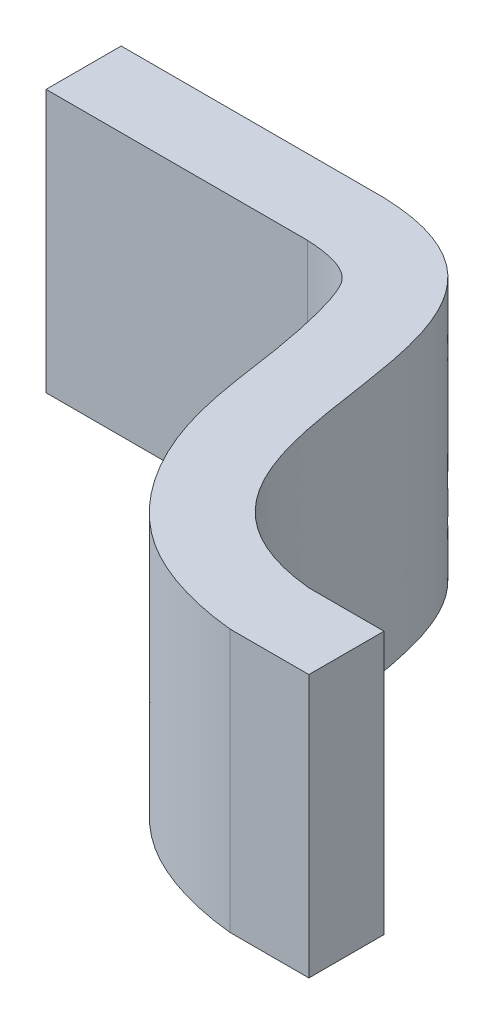
ISO-10303-21;
HEADER;
FILE_DESCRIPTION(('STEP AP214'),'2;1');
FILE_NAME('part.step','',(''),(''),'','','');
FILE_SCHEMA(('AUTOMOTIVE_DESIGN { 1 0 10303 214 1 1 1 1 }'));
ENDSEC;
DATA;
#1=APPLICATION_CONTEXT('core data for automotive mechanical design processes');
#2=APPLICATION_PROTOCOL_DEFINITION('international standard','automotive_design',2000,#1);
#3=PRODUCT_CONTEXT('',#1,'mechanical');
#4=PRODUCT('Part','Part','',(#3));
#5=PRODUCT_RELATED_PRODUCT_CATEGORY('part','',(#4));
#6=PRODUCT_DEFINITION_FORMATION('','',#4);
#7=PRODUCT_DEFINITION_CONTEXT('part definition',#1,'design');
#8=PRODUCT_DEFINITION('design','',#6,#7);
#9=PRODUCT_DEFINITION_SHAPE('','',#8);
#10=(LENGTH_UNIT() NAMED_UNIT(*) SI_UNIT(.MILLI.,.METRE.));
#11=(NAMED_UNIT(*) PLANE_ANGLE_UNIT() SI_UNIT($,.RADIAN.));
#12=(NAMED_UNIT(*) SI_UNIT($,.STERADIAN.) SOLID_ANGLE_UNIT());
#13=UNCERTAINTY_MEASURE_WITH_UNIT(LENGTH_MEASURE(1.E-05),#10,'distance_accuracy_value','');
#14=(GEOMETRIC_REPRESENTATION_CONTEXT(3) GLOBAL_UNCERTAINTY_ASSIGNED_CONTEXT((#13)) GLOBAL_UNIT_ASSIGNED_CONTEXT((#10,
#11,#12)) REPRESENTATION_CONTEXT('',''));
#15=CARTESIAN_POINT('',(0.,0.,0.));
#16=DIRECTION('',(0.,0.,1.));
#17=DIRECTION('',(1.,0.,0.));
#18=AXIS2_PLACEMENT_3D('',#15,#16,#17);
#19=CARTESIAN_POINT('',(0.381074398756027,2.52309917032561,1.20000011583518));
#20=DIRECTION('',(0.,-1.,-4.37113882867379E-08));
#21=DIRECTION('',(1.,0.,0.));
#22=AXIS2_PLACEMENT_3D('',#19,#20,#21);
#23=PLANE('',#22);
#24=CARTESIAN_POINT('',(-6.65392560124397,2.52309917906789,1.00000011583518));
#25=CARTESIAN_POINT('',(-6.6760213847098,2.52309917916311,0.997821625647133));
#26=CARTESIAN_POINT('',(-6.69813368756547,2.5230991793072,0.994525254588134));
#27=CARTESIAN_POINT('',(-6.74194760453987,2.52309917972469,0.984974262074383));
#28=CARTESIAN_POINT('',(-6.76364199343851,2.5230991799995,0.978687395714405));
#29=CARTESIAN_POINT('',(-6.8010868913745,2.52309918063201,0.964217324172014));
#30=CARTESIAN_POINT('',(-6.81710358266756,2.52309918095865,0.956744419949615));
#31=CARTESIAN_POINT('',(-6.84769864594612,2.52309918171697,0.939396173252146));
#32=CARTESIAN_POINT('',(-6.86228342605002,2.52309918214814,0.929532290820285));
#33=CARTESIAN_POINT('',(-6.88912475678651,2.52309918309555,0.907858082970573));
#34=CARTESIAN_POINT('',(-6.90144309560176,2.52309918360844,0.896124342958262));
#35=CARTESIAN_POINT('',(-6.92409093426443,2.52309918471315,0.870851464463273));
#36=CARTESIAN_POINT('',(-6.93441702178863,2.5230991853051,0.857309294454853));
#37=CARTESIAN_POINT('',(-6.96671116783855,2.52309918745188,0.808196656260226));
#38=CARTESIAN_POINT('',(-6.98363339651492,2.52309918914941,0.769361671126784));
#39=CARTESIAN_POINT('',(-7.00636675343762,2.52309919217834,0.70006788295555));
#40=CARTESIAN_POINT('',(-7.01392037587509,2.52309919349072,0.670044134037491));
#41=CARTESIAN_POINT('',(-7.02679822502435,2.523099196139,0.609458553545979));
#42=CARTESIAN_POINT('',(-7.03211866901882,2.52309919747493,0.578895899629316));
#43=CARTESIAN_POINT('',(-7.04522373011164,2.52309920105377,0.497021613893752));
#44=CARTESIAN_POINT('',(-7.05225323067938,2.52309920330128,0.445604791047077));
#45=CARTESIAN_POINT('',(-7.06582589653957,2.52309920665086,0.368975308105409));
#46=CARTESIAN_POINT('',(-7.07085237182358,2.52309920776336,0.343524341633868));
#47=CARTESIAN_POINT('',(-7.08288891244714,2.52309920996658,0.293120463878792));
#48=CARTESIAN_POINT('',(-7.0898957194452,2.52309921105734,0.268166805951377));
#49=CARTESIAN_POINT('',(-7.10753002382366,2.52309921323841,0.218269756020573));
#50=CARTESIAN_POINT('',(-7.11829723428463,2.52309921432677,0.193370816281339));
#51=CARTESIAN_POINT('',(-7.13813270077437,2.52309921586495,0.158181376299541));
#52=CARTESIAN_POINT('',(-7.14532993400949,2.52309921636052,0.146844082596574));
#53=CARTESIAN_POINT('',(-7.16104748346313,2.52309921730947,0.125134668490086));
#54=CARTESIAN_POINT('',(-7.1695665343253,2.52309921776288,0.114761640040044));
#55=CARTESIAN_POINT('',(-7.19090199977994,2.52309921875355,0.0920977228508137));
#56=CARTESIAN_POINT('',(-7.20421803422598,2.52309921927065,0.0802681611591474));
#57=CARTESIAN_POINT('',(-7.23279289498045,2.52309922019085,0.0592163446175961));
#58=CARTESIAN_POINT('',(-7.24805496936829,2.52309922059377,0.0499985337989562));
#59=CARTESIAN_POINT('',(-7.28054440722777,2.52309922129869,0.0338719510890802));
#60=CARTESIAN_POINT('',(-7.29782779482495,2.52309922159565,0.0270782714989052));
#61=CARTESIAN_POINT('',(-7.33319650573112,2.52309922208002,0.0159971892214253));
#62=CARTESIAN_POINT('',(-7.35128360657443,2.52309922226717,0.0117156730828422));
#63=CARTESIAN_POINT('',(-7.38352182929289,2.5230992225183,0.0059706276691555));
#64=CARTESIAN_POINT('',(-7.39760256337062,2.52309922260085,0.00408194344411804));
#65=CARTESIAN_POINT('',(-7.4257638425411,2.5230992227211,0.00133095304899247));
#66=CARTESIAN_POINT('',(-7.43984365839325,2.52309922275911,0.000461351631184867));
#67=CARTESIAN_POINT('',(-7.45392560124401,2.52309922277927,1.1583517777948E-07));
#68=B_SPLINE_CURVE_WITH_KNOTS('',3,(#24,#25,#26,#27,#28,#29,#30,#31,#32,#33,#34,#35,#36,#37,#38,
#39,#40,#41,#42,#43,#44,#45,#46,#47,#48,#49,#50,#51,#52,#53,#54,#55,#56,#57,#58,#59,#60,#61,#62,
#63,#64,#65,#66,#67),.UNSPECIFIED.,.F.,.F.,(4,2,2,2,2,2,2,2,2,2,2,2,2,2,2,2,2,2,2,2,2,4),(0.,
0.0667821137090891,0.134301214684032,0.187128508823995,0.239707439757743,0.290518731452934,
0.341416294675061,0.466712259088972,0.559563019654511,0.652570428897923,0.808245450373597,
0.886023921415196,0.963675157190788,1.04458784966541,1.08478909463837,1.12495209032638,
1.17807587168457,1.2312895104201,1.28677003517691,1.34238004906255,1.38496468867345,
1.42724258099923),.UNSPECIFIED.);
#69=CARTESIAN_POINT('',(-6.65392560124397,2.52309917906789,1.00000011583518));
#70=VERTEX_POINT('',#69);
#71=CARTESIAN_POINT('',(-7.45392560124397,2.52309922277927,1.15835178959856E-07));
#72=VERTEX_POINT('',#71);
#73=EDGE_CURVE('E11',#70,#72,#68,.T.);
#74=ORIENTED_EDGE('',*,*,#73,.F.);
#75=DIRECTION('',(-1.,0.,0.));
#76=VECTOR('',#75,1.);
#77=CARTESIAN_POINT('',(-6.45392560124397,2.52309917906788,1.00000011583518));
#78=LINE('',#77,#76);
#79=CARTESIAN_POINT('',(-6.45392560124397,2.52309917906789,1.00000011583518));
#80=VERTEX_POINT('',#79);
#81=EDGE_CURVE('E177',#80,#70,#78,.T.);
#82=ORIENTED_EDGE('',*,*,#81,.F.);
#83=DIRECTION('',(0.,4.37113878426487E-08,-0.999999999999999));
#84=VECTOR('',#83,1.);
#85=CARTESIAN_POINT('',(-6.45392560124397,2.52309917032561,1.20000011583518));
#86=LINE('',#85,#84);
#87=CARTESIAN_POINT('',(-6.45392560124397,2.52309917032561,1.20000011583518));
#88=VERTEX_POINT('',#87);
#89=EDGE_CURVE('E156',#88,#80,#86,.T.);
#90=ORIENTED_EDGE('',*,*,#89,.F.);
#91=DIRECTION('',(-1.,0.,0.));
#92=VECTOR('',#91,1.);
#93=CARTESIAN_POINT('',(-6.45392560124397,2.52309917032561,1.20000011583518));
#94=LINE('',#93,#92);
#95=CARTESIAN_POINT('',(-6.66372477809197,2.52309917032561,1.20000011583518));
#96=VERTEX_POINT('',#95);
#97=EDGE_CURVE('E147',#88,#96,#94,.T.);
#98=ORIENTED_EDGE('',*,*,#97,.T.);
#99=CARTESIAN_POINT('',(-6.66372477809197,2.52309917032561,1.20000011583518));
#100=CARTESIAN_POINT('',(-6.68235816480651,2.52309917040612,1.19815826251359));
#101=CARTESIAN_POINT('',(-6.70093498946342,2.52309917051351,1.19570148608563));
#102=CARTESIAN_POINT('',(-6.73791221278168,2.52309917078471,1.18949708649844));
#103=CARTESIAN_POINT('',(-6.75631214417819,2.52309917094865,1.18574668900368));
#104=CARTESIAN_POINT('',(-6.79295513620438,2.52309917133702,1.17686171267063));
#105=CARTESIAN_POINT('',(-6.8111952940445,2.52309917156199,1.1717149784766));
#106=CARTESIAN_POINT('',(-6.84717172345389,2.52309917207712,1.15993018576616));
#107=CARTESIAN_POINT('',(-6.86490837899947,2.52309917236723,1.15329330005595));
#108=CARTESIAN_POINT('',(-6.90549462665057,2.52309917313077,1.13582558687806));
#109=CARTESIAN_POINT('',(-6.92807290255751,2.52309917363307,1.12433438176826));
#110=CARTESIAN_POINT('',(-6.97096829666688,2.5230991747892,1.09788516164198));
#111=CARTESIAN_POINT('',(-6.9912955036889,2.52309917544231,1.08294362493377));
#112=CARTESIAN_POINT('',(-7.02796037846709,2.5230991768155,1.0515286278821));
#113=CARTESIAN_POINT('',(-7.04448684621663,2.52309917752611,1.03527193186483));
#114=CARTESIAN_POINT('',(-7.07542126022009,2.52309917903329,1.00079161319614));
#115=CARTESIAN_POINT('',(-7.08982362168071,2.52309917983008,0.982563016394579));
#116=CARTESIAN_POINT('',(-7.11808537102814,2.52309918158959,0.942310234871584));
#117=CARTESIAN_POINT('',(-7.1316696505039,2.52309918256072,0.92009344839241));
#118=CARTESIAN_POINT('',(-7.15605550233222,2.52309918456551,0.874229233248659));
#119=CARTESIAN_POINT('',(-7.16686079670802,2.52309918559908,0.850583771081586));
#120=CARTESIAN_POINT('',(-7.18656671922941,2.52309918779927,0.800249242615178));
#121=CARTESIAN_POINT('',(-7.19523524065515,2.52309918896982,0.773470351336701));
#122=CARTESIAN_POINT('',(-7.20995546192352,2.52309919134218,0.719197095461251));
#123=CARTESIAN_POINT('',(-7.21600397870322,2.52309919254403,0.691701903357667));
#124=CARTESIAN_POINT('',(-7.22444466903982,2.52309919451031,0.646718698606681));
#125=CARTESIAN_POINT('',(-7.22735928328766,2.52309919527076,0.629321559392239));
#126=CARTESIAN_POINT('',(-7.23280873084802,2.52309919679438,0.594465151128248));
#127=CARTESIAN_POINT('',(-7.23534347790799,2.52309919755755,0.577005868887041));
#128=CARTESIAN_POINT('',(-7.24043139259136,2.52309919908365,0.542092921691093));
#129=CARTESIAN_POINT('',(-7.24298455656837,2.52309919984657,0.524639256302372));
#130=CARTESIAN_POINT('',(-7.24852784389109,2.52309920136919,0.489805710668549));
#131=CARTESIAN_POINT('',(-7.25151784908981,2.52309920212889,0.472425811776498));
#132=CARTESIAN_POINT('',(-7.2593930344497,2.52309920398264,0.430017002300889));
#133=CARTESIAN_POINT('',(-7.26452884999095,2.52309920507476,0.405032274084384));
#134=CARTESIAN_POINT('',(-7.27334542318719,2.52309920670167,0.367812997253911));
#135=CARTESIAN_POINT('',(-7.27647049737492,2.5230992072422,0.355447076609879));
#136=CARTESIAN_POINT('',(-7.28323298853228,2.52309920831701,0.330858185679059));
#137=CARTESIAN_POINT('',(-7.28687011761276,2.52309920885128,0.318635139218728));
#138=CARTESIAN_POINT('',(-7.29334407740757,2.52309920969326,0.299373483484268));
#139=CARTESIAN_POINT('',(-7.2959066269859,2.52309921000491,0.292244069713015));
#140=CARTESIAN_POINT('',(-7.30148473904446,2.52309921061997,0.278171981621579));
#141=CARTESIAN_POINT('',(-7.30449961539945,2.52309921092339,0.271229042931886));
#142=CARTESIAN_POINT('',(-7.31076754414832,2.5230992114581,0.259000030679789));
#143=CARTESIAN_POINT('',(-7.31387365469767,2.52309921169237,0.25364485399594));
#144=CARTESIAN_POINT('',(-7.32080381678023,2.52309921209967,0.24431611299945));
#145=CARTESIAN_POINT('',(-7.32450000384901,2.52309921227667,0.240254092219712));
#146=CARTESIAN_POINT('',(-7.33394897363332,2.5230992126361,0.232076082050639));
#147=CARTESIAN_POINT('',(-7.33998642044214,2.52309921280446,0.228304167822837));
#148=CARTESIAN_POINT('',(-7.34920308092036,2.52309921302749,0.223113207552908));
#149=CARTESIAN_POINT('',(-7.35228960650534,2.5230992130967,0.22146627616053));
#150=CARTESIAN_POINT('',(-7.35857989092758,2.52309921323393,0.218417487597743));
#151=CARTESIAN_POINT('',(-7.36178332741555,2.52309921330194,0.217015010267045));
#152=CARTESIAN_POINT('',(-7.37090352258754,2.52309921346706,0.213465158251479));
#153=CARTESIAN_POINT('',(-7.37693693346537,2.52309921354377,0.211621815116613));
#154=CARTESIAN_POINT('',(-7.38670569686491,2.52309921364324,0.209137323184538));
#155=CARTESIAN_POINT('',(-7.39039887638499,2.52309921367532,0.20830980891405));
#156=CARTESIAN_POINT('',(-7.39781445722382,2.52309921373823,0.206799773992657));
#157=CARTESIAN_POINT('',(-7.40153685423347,2.52309921376905,0.206117232362365));
#158=CARTESIAN_POINT('',(-7.41389968086125,2.52309921386204,0.204032192061863));
#159=CARTESIAN_POINT('',(-7.42257948480063,2.52309921391219,0.20286122616549));
#160=CARTESIAN_POINT('',(-7.43563044947402,2.52309921397233,0.201476711110414));
#161=CARTESIAN_POINT('',(-7.43998307619468,2.52309921398985,0.201077337289078));
#162=CARTESIAN_POINT('',(-7.44869872182374,2.52309921401853,0.200424106581843));
#163=CARTESIAN_POINT('',(-7.45306173976726,2.52309921402969,0.200170236676359));
#164=CARTESIAN_POINT('',(-7.45742938297997,2.523099214037,0.200000115835179));
#165=B_SPLINE_CURVE_WITH_KNOTS('',3,(#99,#100,#101,#102,#103,#104,#105,#106,#107,#108,#109,#110,
#111,#112,#113,#114,#115,#116,#117,#118,#119,#120,#121,#122,#123,#124,#125,#126,#127,#128,#129,
#130,#131,#132,#133,#134,#135,#136,#137,#138,#139,#140,#141,#142,#143,#144,#145,#146,#147,#148,
#149,#150,#151,#152,#153,#154,#155,#156,#157,#158,#159,#160,#161,#162,#163,#164),.UNSPECIFIED.,
.F.,.F.,(4,2,2,2,2,2,2,2,2,2,2,2,2,2,2,2,2,2,2,2,2,2,2,2,2,2,2,2,2,2,2,2,4),(0.,
0.0561681589095707,0.112457534383138,0.16925357861237,0.226005077906886,0.301715004036544,
0.377070566346001,0.446424912055152,0.515958475234817,0.593880428548584,0.671697467408244,
0.75596451716301,0.84033365838221,0.89324779263184,0.946173923407372,0.999089848164163,
1.05199148781442,1.12847716172405,1.16673541076623,1.20497223539784,1.22769072756634,
1.25037510056687,1.26886797593494,1.28517999290264,1.30634908955327,1.3168513921173,
1.32732665061524,1.34619861049414,1.35755137220421,1.36890248990409,1.39515927363249,
1.40827024085607,1.42138003473644),.UNSPECIFIED.);
#166=CARTESIAN_POINT('',(-7.45742938297997,2.523099214037,0.200000115835179));
#167=VERTEX_POINT('',#166);
#168=EDGE_CURVE('E135',#96,#167,#165,.T.);
#169=ORIENTED_EDGE('',*,*,#168,.T.);
#170=DIRECTION('',(1.,0.,0.));
#171=VECTOR('',#170,1.);
#172=CARTESIAN_POINT('',(-8.15392560124397,2.523099214037,0.200000115835177));
#173=LINE('',#172,#171);
#174=CARTESIAN_POINT('',(-8.15392560124397,2.523099214037,0.200000115835179));
#175=VERTEX_POINT('',#174);
#176=EDGE_CURVE('E97',#175,#167,#173,.T.);
#177=ORIENTED_EDGE('',*,*,#176,.F.);
#178=DIRECTION('',(0.,4.37113878426487E-08,-0.999999999999999));
#179=VECTOR('',#178,1.);
#180=CARTESIAN_POINT('',(-8.15392560124397,2.523099214037,0.200000115835179));
#181=LINE('',#180,#179);
#182=CARTESIAN_POINT('',(-8.15392560124397,2.52309922277927,1.15835178959856E-07));
#183=VERTEX_POINT('',#182);
#184=EDGE_CURVE('E102',#175,#183,#181,.T.);
#185=ORIENTED_EDGE('',*,*,#184,.T.);
#186=DIRECTION('',(-1.,0.,0.));
#187=VECTOR('',#186,1.);
#188=CARTESIAN_POINT('',(-7.45392560124397,2.52309922277928,1.15835178959856E-07));
#189=LINE('',#188,#187);
#190=EDGE_CURVE('E95',#72,#183,#189,.T.);
#191=ORIENTED_EDGE('',*,*,#190,.F.);
#192=EDGE_LOOP('',(#74,#82,#90,#98,#169,#177,#185,#191));
#193=FACE_BOUND('',#192,.T.);
#194=ADVANCED_FACE('F17',(#193),#23,.T.);
#195=CARTESIAN_POINT('',(0.381074398756027,3.22309917032561,1.20000014643315));
#196=DIRECTION('',(0.,-1.,-4.37113882867379E-08));
#197=DIRECTION('',(1.,0.,0.));
#198=AXIS2_PLACEMENT_3D('',#195,#196,#197);
#199=PLANE('',#198);
#200=DIRECTION('',(-1.,0.,0.));
#201=VECTOR('',#200,1.);
#202=CARTESIAN_POINT('',(-6.45392560124397,3.22309917906788,1.00000014643315));
#203=LINE('',#202,#201);
#204=CARTESIAN_POINT('',(-6.45392560124397,3.22309917906789,1.00000014643315));
#205=VERTEX_POINT('',#204);
#206=CARTESIAN_POINT('',(-6.65392560124397,3.22309917906789,1.00000014643315));
#207=VERTEX_POINT('',#206);
#208=EDGE_CURVE('E30',#205,#207,#203,.T.);
#209=ORIENTED_EDGE('',*,*,#208,.T.);
#210=CARTESIAN_POINT('',(-6.65392560124397,3.22309917906789,1.00000014643315));
#211=CARTESIAN_POINT('',(-6.6760213847098,3.22309917916311,0.997821656245104));
#212=CARTESIAN_POINT('',(-6.69813368756547,3.2230991793072,0.994525285186106));
#213=CARTESIAN_POINT('',(-6.74194760453987,3.22309917972469,0.984974292672355));
#214=CARTESIAN_POINT('',(-6.76364199343851,3.2230991799995,0.978687426312377));
#215=CARTESIAN_POINT('',(-6.8010868913745,3.22309918063201,0.964217354769986));
#216=CARTESIAN_POINT('',(-6.81710358266756,3.22309918095865,0.956744450547586));
#217=CARTESIAN_POINT('',(-6.84769864594612,3.22309918171697,0.939396203850117));
#218=CARTESIAN_POINT('',(-6.86228342605002,3.22309918214814,0.929532321418256));
#219=CARTESIAN_POINT('',(-6.88912475678651,3.22309918309555,0.907858113568546));
#220=CARTESIAN_POINT('',(-6.90144309560176,3.22309918360844,0.896124373556235));
#221=CARTESIAN_POINT('',(-6.92409093426443,3.22309918471315,0.870851495061246));
#222=CARTESIAN_POINT('',(-6.93441702178864,3.2230991853051,0.857309325052826));
#223=CARTESIAN_POINT('',(-6.96671116783855,3.22309918745188,0.808196686858197));
#224=CARTESIAN_POINT('',(-6.98363339651492,3.22309918914941,0.769361701724756));
#225=CARTESIAN_POINT('',(-7.00636675343762,3.22309919217834,0.700067913553522));
#226=CARTESIAN_POINT('',(-7.01392037587509,3.22309919349072,0.670044164635463));
#227=CARTESIAN_POINT('',(-7.02679822502436,3.223099196139,0.609458584143951));
#228=CARTESIAN_POINT('',(-7.03211866901882,3.22309919747493,0.578895930227288));
#229=CARTESIAN_POINT('',(-7.04522373011164,3.22309920105377,0.497021644491724));
#230=CARTESIAN_POINT('',(-7.05225323067938,3.22309920330128,0.445604821645049));
#231=CARTESIAN_POINT('',(-7.06582589653957,3.22309920665086,0.368975338703381));
#232=CARTESIAN_POINT('',(-7.07085237182357,3.22309920776336,0.343524372231839));
#233=CARTESIAN_POINT('',(-7.08288891244714,3.22309920996658,0.293120494476764));
#234=CARTESIAN_POINT('',(-7.0898957194452,3.22309921105734,0.268166836549349));
#235=CARTESIAN_POINT('',(-7.10753002382366,3.22309921323841,0.218269786618545));
#236=CARTESIAN_POINT('',(-7.11829723428463,3.22309921432677,0.193370846879311));
#237=CARTESIAN_POINT('',(-7.13813270077437,3.22309921586495,0.158181406897513));
#238=CARTESIAN_POINT('',(-7.14532993400949,3.22309921636052,0.146844113194547));
#239=CARTESIAN_POINT('',(-7.16104748346313,3.22309921730947,0.125134699088058));
#240=CARTESIAN_POINT('',(-7.1695665343253,3.22309921776288,0.114761670638016));
#241=CARTESIAN_POINT('',(-7.19090199977994,3.22309921875355,0.0920977534487856));
#242=CARTESIAN_POINT('',(-7.20421803422598,3.22309921927065,0.0802681917571193));
#243=CARTESIAN_POINT('',(-7.23279289498045,3.22309922019085,0.059216375215568));
#244=CARTESIAN_POINT('',(-7.24805496936829,3.22309922059377,0.049998564396928));
#245=CARTESIAN_POINT('',(-7.28054440722777,3.22309922129869,0.0338719816870522));
#246=CARTESIAN_POINT('',(-7.29782779482495,3.22309922159565,0.0270783020968775));
#247=CARTESIAN_POINT('',(-7.33319650573112,3.22309922208002,0.0159972198193975));
#248=CARTESIAN_POINT('',(-7.35128360657443,3.22309922226717,0.0117157036808142));
#249=CARTESIAN_POINT('',(-7.38352182929289,3.2230992225183,0.00597065826712729));
#250=CARTESIAN_POINT('',(-7.39760256337062,3.22309922260085,0.00408197404208983));
#251=CARTESIAN_POINT('',(-7.4257638425411,3.2230992227211,0.00133098364696428));
#252=CARTESIAN_POINT('',(-7.43984365839325,3.22309922275911,0.000461382229156693));
#253=CARTESIAN_POINT('',(-7.45392560124401,3.22309922277927,1.46433149535788E-07));
#254=B_SPLINE_CURVE_WITH_KNOTS('',3,(#210,#211,#212,#213,#214,#215,#216,#217,#218,#219,#220,
#221,#222,#223,#224,#225,#226,#227,#228,#229,#230,#231,#232,#233,#234,#235,#236,#237,#238,#239,
#240,#241,#242,#243,#244,#245,#246,#247,#248,#249,#250,#251,#252,#253),.UNSPECIFIED.,.F.,.F.,(4,
2,2,2,2,2,2,2,2,2,2,2,2,2,2,2,2,2,2,2,2,4),(0.,0.0667821137090888,0.134301214684031,
0.187128508823994,0.239707439757743,0.290518731452934,0.34141629467506,0.466712259088972,
0.559563019654511,0.652570428897923,0.808245450373597,0.886023921415196,0.963675157190788,
1.04458784966541,1.08478909463837,1.12495209032638,1.17807587168457,1.2312895104201,
1.28677003517691,1.34238004906255,1.38496468867345,1.42724258099923),.UNSPECIFIED.);
#255=CARTESIAN_POINT('',(-7.45392560124397,3.22309922277927,1.46433150760572E-07));
#256=VERTEX_POINT('',#255);
#257=EDGE_CURVE('E159',#207,#256,#254,.T.);
#258=ORIENTED_EDGE('',*,*,#257,.T.);
#259=DIRECTION('',(-1.,0.,0.));
#260=VECTOR('',#259,1.);
#261=CARTESIAN_POINT('',(-7.45392560124397,3.22309922277928,1.46433150760572E-07));
#262=LINE('',#261,#260);
#263=CARTESIAN_POINT('',(-8.15392560124397,3.22309922277927,1.46433150760572E-07));
#264=VERTEX_POINT('',#263);
#265=EDGE_CURVE('E96',#256,#264,#262,.T.);
#266=ORIENTED_EDGE('',*,*,#265,.T.);
#267=DIRECTION('',(0.,4.37113856222026E-08,-0.999999999999999));
#268=VECTOR('',#267,1.);
#269=CARTESIAN_POINT('',(-8.15392560124397,3.223099214037,0.200000146433151));
#270=LINE('',#269,#268);
#271=CARTESIAN_POINT('',(-8.15392560124397,3.223099214037,0.200000146433151));
#272=VERTEX_POINT('',#271);
#273=EDGE_CURVE('E141',#272,#264,#270,.T.);
#274=ORIENTED_EDGE('',*,*,#273,.F.);
#275=DIRECTION('',(1.,0.,0.));
#276=VECTOR('',#275,1.);
#277=CARTESIAN_POINT('',(-8.15392560124397,3.223099214037,0.200000146433149));
#278=LINE('',#277,#276);
#279=CARTESIAN_POINT('',(-7.45742938297997,3.223099214037,0.200000146433151));
#280=VERTEX_POINT('',#279);
#281=EDGE_CURVE('E193',#272,#280,#278,.T.);
#282=ORIENTED_EDGE('',*,*,#281,.T.);
#283=CARTESIAN_POINT('',(-6.66372477809197,3.22309917032561,1.20000014643315));
#284=CARTESIAN_POINT('',(-6.68235816480651,3.22309917040612,1.19815829311156));
#285=CARTESIAN_POINT('',(-6.70093498946342,3.22309917051351,1.1957015166836));
#286=CARTESIAN_POINT('',(-6.73791221278168,3.22309917078471,1.18949711709641));
#287=CARTESIAN_POINT('',(-6.75631214417819,3.22309917094865,1.18574671960165));
#288=CARTESIAN_POINT('',(-6.79295513620438,3.22309917133702,1.1768617432686));
#289=CARTESIAN_POINT('',(-6.8111952940445,3.22309917156199,1.17171500907457));
#290=CARTESIAN_POINT('',(-6.84717172345389,3.22309917207712,1.15993021636413));
#291=CARTESIAN_POINT('',(-6.86490837899947,3.22309917236723,1.15329333065392));
#292=CARTESIAN_POINT('',(-6.90549462665057,3.22309917313077,1.13582561747603));
#293=CARTESIAN_POINT('',(-6.92807290255751,3.22309917363307,1.12433441236623));
#294=CARTESIAN_POINT('',(-6.97096829666688,3.2230991747892,1.09788519223995));
#295=CARTESIAN_POINT('',(-6.9912955036889,3.22309917544231,1.08294365553175));
#296=CARTESIAN_POINT('',(-7.02796037846709,3.2230991768155,1.05152865848007));
#297=CARTESIAN_POINT('',(-7.04448684621663,3.22309917752611,1.03527196246281));
#298=CARTESIAN_POINT('',(-7.07542126022009,3.22309917903329,1.00079164379411));
#299=CARTESIAN_POINT('',(-7.08982362168071,3.22309917983008,0.98256304699255));
#300=CARTESIAN_POINT('',(-7.11808537102814,3.22309918158959,0.942310265469555));
#301=CARTESIAN_POINT('',(-7.1316696505039,3.22309918256072,0.920093478990381));
#302=CARTESIAN_POINT('',(-7.15605550233222,3.22309918456551,0.87422926384663));
#303=CARTESIAN_POINT('',(-7.16686079670802,3.22309918559908,0.850583801679557));
#304=CARTESIAN_POINT('',(-7.18656671922941,3.22309918779927,0.80024927321315));
#305=CARTESIAN_POINT('',(-7.19523524065514,3.22309918896982,0.773470381934672));
#306=CARTESIAN_POINT('',(-7.20995546192352,3.22309919134218,0.719197126059223));
#307=CARTESIAN_POINT('',(-7.21600397870321,3.22309919254403,0.691701933955639));
#308=CARTESIAN_POINT('',(-7.22444466903983,3.22309919451031,0.646718729204653));
#309=CARTESIAN_POINT('',(-7.22735928328766,3.22309919527076,0.629321589990211));
#310=CARTESIAN_POINT('',(-7.23280873084802,3.22309919679438,0.59446518172622));
#311=CARTESIAN_POINT('',(-7.235343477908,3.22309919755755,0.577005899485013));
#312=CARTESIAN_POINT('',(-7.24043139259136,3.22309919908365,0.542092952289065));
#313=CARTESIAN_POINT('',(-7.24298455656837,3.22309919984657,0.524639286900344));
#314=CARTESIAN_POINT('',(-7.24852784389109,3.22309920136919,0.489805741266521));
#315=CARTESIAN_POINT('',(-7.25151784908981,3.22309920212889,0.47242584237447));
#316=CARTESIAN_POINT('',(-7.2593930344497,3.22309920398264,0.430017032898861));
#317=CARTESIAN_POINT('',(-7.26452884999095,3.22309920507476,0.405032304682356));
#318=CARTESIAN_POINT('',(-7.27334542318719,3.22309920670166,0.367813027851883));
#319=CARTESIAN_POINT('',(-7.27647049737492,3.22309920724219,0.355447107207851));
#320=CARTESIAN_POINT('',(-7.28323298853228,3.22309920831701,0.330858216277031));
#321=CARTESIAN_POINT('',(-7.28687011761276,3.22309920885131,0.3186351698167));
#322=CARTESIAN_POINT('',(-7.29334407740757,3.22309920969325,0.29937351408224));
#323=CARTESIAN_POINT('',(-7.2959066269859,3.22309921000488,0.292244100310987));
#324=CARTESIAN_POINT('',(-7.30148473904446,3.22309921062001,0.278172012219551));
#325=CARTESIAN_POINT('',(-7.30449961539945,3.22309921092352,0.271229073529858));
#326=CARTESIAN_POINT('',(-7.31076754414832,3.22309921145799,0.259000061277761));
#327=CARTESIAN_POINT('',(-7.31387365469767,3.22309921169199,0.253644884593912));
#328=CARTESIAN_POINT('',(-7.32080381678023,3.22309921209999,0.244316143597422));
#329=CARTESIAN_POINT('',(-7.32450000384901,3.22309921227781,0.240254122817684));
#330=CARTESIAN_POINT('',(-7.33394897363332,3.22309921263433,0.232076112648611));
#331=CARTESIAN_POINT('',(-7.33998642044214,3.22309921279752,0.228304198420809));
#332=CARTESIAN_POINT('',(-7.34920308092036,3.22309921302631,0.22311323815088));
#333=CARTESIAN_POINT('',(-7.35228960650534,3.22309921309965,0.221466306758503));
#334=CARTESIAN_POINT('',(-7.35857989092758,3.22309921323099,0.218417518195714));
#335=CARTESIAN_POINT('',(-7.36178332741555,3.22309921328903,0.217015040865017));
#336=CARTESIAN_POINT('',(-7.37090352258754,3.22309921343936,0.21346518884945));
#337=CARTESIAN_POINT('',(-7.37693693346537,3.22309921352181,0.211621845714585));
#338=CARTESIAN_POINT('',(-7.38670569686491,3.22309921363485,0.20913735378251));
#339=CARTESIAN_POINT('',(-7.39039887638499,3.22309921367301,0.208309839512022));
#340=CARTESIAN_POINT('',(-7.39781445722382,3.22309921374053,0.206799804590628));
#341=CARTESIAN_POINT('',(-7.40153685423347,3.22309921376988,0.206117262960336));
#342=CARTESIAN_POINT('',(-7.41389968086125,3.22309921386012,0.204032222659834));
#343=CARTESIAN_POINT('',(-7.42257948480063,3.22309921391181,0.202861256763462));
#344=CARTESIAN_POINT('',(-7.43563044947402,3.22309921397252,0.201476741708386));
#345=CARTESIAN_POINT('',(-7.43998307619468,3.22309921398994,0.201077367887049));
#346=CARTESIAN_POINT('',(-7.44869872182374,3.22309921401843,0.200424137179815));
#347=CARTESIAN_POINT('',(-7.45306173976726,3.2230992140295,0.200170267274331));
#348=CARTESIAN_POINT('',(-7.45742938297997,3.223099214037,0.200000146433151));
#349=B_SPLINE_CURVE_WITH_KNOTS('',3,(#283,#284,#285,#286,#287,#288,#289,#290,#291,#292,#293,
#294,#295,#296,#297,#298,#299,#300,#301,#302,#303,#304,#305,#306,#307,#308,#309,#310,#311,#312,
#313,#314,#315,#316,#317,#318,#319,#320,#321,#322,#323,#324,#325,#326,#327,#328,#329,#330,#331,
#332,#333,#334,#335,#336,#337,#338,#339,#340,#341,#342,#343,#344,#345,#346,#347,#348),
.UNSPECIFIED.,.F.,.F.,(4,2,2,2,2,2,2,2,2,2,2,2,2,2,2,2,2,2,2,2,2,2,2,2,2,2,2,2,2,2,2,2,4),(0.,
0.0561681589095705,0.112457534383138,0.16925357861237,0.226005077906886,0.301715004036544,
0.377070566346001,0.446424912055152,0.515958475234816,0.593880428548584,0.671697467408244,
0.755964517163009,0.840333658382208,0.893247792631839,0.946173923407371,0.999089848164162,
1.05199148781442,1.12847716172405,1.16673541076623,1.20497223539784,1.22769072756634,
1.25037510056687,1.26886797593494,1.28517999290264,1.30634908955327,1.31685139211729,
1.32732665061524,1.34619861049414,1.35755137220421,1.36890248990409,1.39515927363249,
1.40827024085607,1.42138003473644),.UNSPECIFIED.);
#350=CARTESIAN_POINT('',(-6.66372477809197,3.22309917032561,1.20000014643315));
#351=VERTEX_POINT('',#350);
#352=EDGE_CURVE('E103',#351,#280,#349,.T.);
#353=ORIENTED_EDGE('',*,*,#352,.F.);
#354=DIRECTION('',(-1.,0.,0.));
#355=VECTOR('',#354,1.);
#356=CARTESIAN_POINT('',(-6.45392560124397,3.22309917032561,1.20000014643315));
#357=LINE('',#356,#355);
#358=CARTESIAN_POINT('',(-6.45392560124397,3.22309917032561,1.20000014643315));
#359=VERTEX_POINT('',#358);
#360=EDGE_CURVE('E165',#359,#351,#357,.T.);
#361=ORIENTED_EDGE('',*,*,#360,.F.);
#362=DIRECTION('',(0.,4.37113878426487E-08,-0.999999999999999));
#363=VECTOR('',#362,1.);
#364=CARTESIAN_POINT('',(-6.45392560124397,3.22309917032561,1.20000014643315));
#365=LINE('',#364,#363);
#366=EDGE_CURVE('E98',#359,#205,#365,.T.);
#367=ORIENTED_EDGE('',*,*,#366,.T.);
#368=EDGE_LOOP('',(#209,#258,#266,#274,#282,#353,#361,#367));
#369=FACE_BOUND('',#368,.T.);
#370=ADVANCED_FACE('F117',(#369),#199,.F.);
#371=CARTESIAN_POINT('',(0.381074398756027,-0.126900829674392,1.2));
#372=DIRECTION('',(0.,-4.37113882867379E-08,1.));
#373=DIRECTION('',(0.,-1.,-4.37113882867379E-08));
#374=AXIS2_PLACEMENT_3D('',#371,#372,#373);
#375=PLANE('',#374);
#376=ORIENTED_EDGE('',*,*,#360,.T.);
#377=DIRECTION('',(0.,-0.999999999999999,-4.37113887942684E-08));
#378=VECTOR('',#377,1.);
#379=CARTESIAN_POINT('',(-6.66372477809197,3.22309917032561,1.20000014643315));
#380=LINE('',#379,#378);
#381=EDGE_CURVE('E151',#351,#96,#380,.T.);
#382=ORIENTED_EDGE('',*,*,#381,.T.);
#383=ORIENTED_EDGE('',*,*,#97,.F.);
#384=DIRECTION('',(0.,0.999999999999999,4.37113878426487E-08));
#385=VECTOR('',#384,1.);
#386=CARTESIAN_POINT('',(-6.45392560124397,2.52309917032561,1.20000011583518));
#387=LINE('',#386,#385);
#388=EDGE_CURVE('E189',#88,#359,#387,.T.);
#389=ORIENTED_EDGE('',*,*,#388,.T.);
#390=EDGE_LOOP('',(#376,#382,#383,#389));
#391=FACE_BOUND('',#390,.T.);
#392=ADVANCED_FACE('F170',(#391),#375,.T.);
#393=CARTESIAN_POINT('',(-8.15392560124397,-0.126900829674392,1.2));
#394=DIRECTION('',(-1.,0.,0.));
#395=DIRECTION('',(0.,-1.,-4.37113882867379E-08));
#396=AXIS2_PLACEMENT_3D('',#393,#394,#395);
#397=PLANE('',#396);
#398=DIRECTION('',(0.,-0.999999999999999,-4.37113883184585E-08));
#399=VECTOR('',#398,1.);
#400=CARTESIAN_POINT('',(-8.15392560124397,3.223099214037,0.200000146433151));
#401=LINE('',#400,#399);
#402=EDGE_CURVE('E153',#272,#175,#401,.T.);
#403=ORIENTED_EDGE('',*,*,#402,.F.);
#404=ORIENTED_EDGE('',*,*,#273,.T.);
#405=DIRECTION('',(0.,0.999999999999999,4.37113882867379E-08));
#406=VECTOR('',#405,1.);
#407=CARTESIAN_POINT('',(-8.15392560124397,2.52309922277927,1.15835178959856E-07));
#408=LINE('',#407,#406);
#409=EDGE_CURVE('E199',#183,#264,#408,.T.);
#410=ORIENTED_EDGE('',*,*,#409,.F.);
#411=ORIENTED_EDGE('',*,*,#184,.F.);
#412=EDGE_LOOP('',(#403,#404,#410,#411));
#413=FACE_BOUND('',#412,.T.);
#414=ADVANCED_FACE('F206',(#413),#397,.T.);
#415=CARTESIAN_POINT('',(-6.45392560124397,-0.126900829674392,1.2));
#416=DIRECTION('',(-1.,0.,0.));
#417=DIRECTION('',(0.,-1.,-4.37113882867379E-08));
#418=AXIS2_PLACEMENT_3D('',#415,#416,#417);
#419=PLANE('',#418);
#420=ORIENTED_EDGE('',*,*,#89,.T.);
#421=DIRECTION('',(0.,-0.999999999999999,-4.37113881598552E-08));
#422=VECTOR('',#421,1.);
#423=CARTESIAN_POINT('',(-6.45392560124397,3.22309917906789,1.00000014643315));
#424=LINE('',#423,#422);
#425=EDGE_CURVE('E198',#205,#80,#424,.T.);
#426=ORIENTED_EDGE('',*,*,#425,.F.);
#427=ORIENTED_EDGE('',*,*,#366,.F.);
#428=ORIENTED_EDGE('',*,*,#388,.F.);
#429=EDGE_LOOP('',(#420,#426,#427,#428));
#430=FACE_BOUND('',#429,.T.);
#431=ADVANCED_FACE('F222',(#430),#419,.F.);
#432=CARTESIAN_POINT('',(0.381074398756027,-0.126900777220726,0.));
#433=DIRECTION('',(0.,-4.37113882867379E-08,1.));
#434=DIRECTION('',(0.,-1.,-4.37113882867379E-08));
#435=AXIS2_PLACEMENT_3D('',#432,#433,#434);
#436=PLANE('',#435);
#437=ORIENTED_EDGE('',*,*,#265,.F.);
#438=DIRECTION('',(0.,-0.999999999999999,-4.37113882867379E-08));
#439=VECTOR('',#438,1.);
#440=CARTESIAN_POINT('',(-7.45392560124397,3.22309922277927,1.46433150760572E-07));
#441=LINE('',#440,#439);
#442=EDGE_CURVE('E88',#256,#72,#441,.T.);
#443=ORIENTED_EDGE('',*,*,#442,.T.);
#444=ORIENTED_EDGE('',*,*,#190,.T.);
#445=ORIENTED_EDGE('',*,*,#409,.T.);
#446=EDGE_LOOP('',(#437,#443,#444,#445));
#447=FACE_BOUND('',#446,.T.);
#448=ADVANCED_FACE('F93',(#447),#436,.F.);
#449=CARTESIAN_POINT('',(-6.65392560124397,5.01772964056189,1.00000022487894));
#450=CARTESIAN_POINT('',(-7.29924299938797,5.01772964333266,0.93661226287194));
#451=CARTESIAN_POINT('',(-6.78982889187097,5.01772968333384,0.0214920441178097));
#452=CARTESIAN_POINT('',(-7.45392560124397,5.01772968427327,2.24878939694144E-07));
#453=B_SPLINE_CURVE_WITH_KNOTS('',3,(#449,#450,#451,#452),.UNSPECIFIED.,.F.,.F.,(4,4),(0.,1.),.UNSPECIFIED.);
#454=DIRECTION('',(0.,-0.999999999999999,-4.37113882867379E-08));
#455=VECTOR('',#454,1.);
#456=SURFACE_OF_LINEAR_EXTRUSION('',#453,#455);
#457=ORIENTED_EDGE('',*,*,#73,.T.);
#458=ORIENTED_EDGE('',*,*,#442,.F.);
#459=ORIENTED_EDGE('',*,*,#257,.F.);
#460=DIRECTION('',(0.,-0.999999999999999,-4.37113881598552E-08));
#461=VECTOR('',#460,1.);
#462=CARTESIAN_POINT('',(-6.65392560124397,3.22309917906789,1.00000014643315));
#463=LINE('',#462,#461);
#464=EDGE_CURVE('E89',#207,#70,#463,.T.);
#465=ORIENTED_EDGE('',*,*,#464,.T.);
#466=EDGE_LOOP('',(#457,#458,#459,#465));
#467=FACE_BOUND('',#466,.T.);
#468=ADVANCED_FACE('F86',(#467),#456,.F.);
#469=CARTESIAN_POINT('',(0.381074398756027,5.01772964056189,1.00000022487894));
#470=DIRECTION('',(0.,-4.37113882867379E-08,1.));
#471=DIRECTION('',(0.,-1.,-4.37113882867379E-08));
#472=AXIS2_PLACEMENT_3D('',#469,#470,#471);
#473=PLANE('',#472);
#474=ORIENTED_EDGE('',*,*,#81,.T.);
#475=ORIENTED_EDGE('',*,*,#464,.F.);
#476=ORIENTED_EDGE('',*,*,#208,.F.);
#477=ORIENTED_EDGE('',*,*,#425,.T.);
#478=EDGE_LOOP('',(#474,#475,#476,#477));
#479=FACE_BOUND('',#478,.T.);
#480=ADVANCED_FACE('F126',(#479),#473,.F.);
#481=CARTESIAN_POINT('',(-6.66372477809197,5.01772963181961,1.20000022487894));
#482=CARTESIAN_POINT('',(-6.76109917959897,5.0177296322377,1.19043537372094));
#483=CARTESIAN_POINT('',(-6.96544759492897,5.01772963465043,1.13523848292794));
#484=CARTESIAN_POINT('',(-7.20604035748997,5.01772964683219,0.85655227210794));
#485=CARTESIAN_POINT('',(-7.23833742725997,5.01772966268883,0.49379478761794));
#486=CARTESIAN_POINT('',(-7.29818549189797,5.01772967295241,0.25899132482694));
#487=CARTESIAN_POINT('',(-7.33604209899997,5.01772967426447,0.22897490490494));
#488=CARTESIAN_POINT('',(-7.37898312658797,5.01772967516896,0.20828275194794));
#489=CARTESIAN_POINT('',(-7.43389149863997,5.01772967549165,0.20090043049794));
#490=CARTESIAN_POINT('',(-7.45742938297997,5.017729675531,0.20000022487894));
#491=B_SPLINE_CURVE_WITH_KNOTS('',3,(#481,#482,#483,#484,#485,#486,#487,#488,#489,#490),
.UNSPECIFIED.,.F.,.F.,(4,1,1,1,1,1,1,4),(-0.005037439357121,0.120331553469,0.245700546295,
0.496438531947,0.747176517599,0.872545510425,0.935230006838,0.997914503251),.UNSPECIFIED.);
#492=DIRECTION('',(0.,-0.999999999999999,-4.37113882867379E-08));
#493=VECTOR('',#492,1.);
#494=SURFACE_OF_LINEAR_EXTRUSION('',#491,#493);
#495=ORIENTED_EDGE('',*,*,#381,.F.);
#496=ORIENTED_EDGE('',*,*,#352,.T.);
#497=DIRECTION('',(0.,-0.999999999999999,-4.37113883184585E-08));
#498=VECTOR('',#497,1.);
#499=CARTESIAN_POINT('',(-7.45742938297997,3.223099214037,0.200000146433151));
#500=LINE('',#499,#498);
#501=EDGE_CURVE('E107',#280,#167,#500,.T.);
#502=ORIENTED_EDGE('',*,*,#501,.T.);
#503=ORIENTED_EDGE('',*,*,#168,.F.);
#504=EDGE_LOOP('',(#495,#496,#502,#503));
#505=FACE_BOUND('',#504,.T.);
#506=ADVANCED_FACE('F119',(#505),#494,.T.);
#507=CARTESIAN_POINT('',(0.381074398756027,5.017729675531,0.20000022487894));
#508=DIRECTION('',(0.,4.37113882867379E-08,-1.));
#509=DIRECTION('',(1.,0.,0.));
#510=AXIS2_PLACEMENT_3D('',#507,#508,#509);
#511=PLANE('',#510);
#512=ORIENTED_EDGE('',*,*,#176,.T.);
#513=ORIENTED_EDGE('',*,*,#501,.F.);
#514=ORIENTED_EDGE('',*,*,#281,.F.);
#515=ORIENTED_EDGE('',*,*,#402,.T.);
#516=EDGE_LOOP('',(#512,#513,#514,#515));
#517=FACE_BOUND('',#516,.T.);
#518=ADVANCED_FACE('F125',(#517),#511,.F.);
#519=CLOSED_SHELL('',(#194,#370,#392,#414,#431,#448,#468,#480,#506,#518));
#520=MANIFOLD_SOLID_BREP('B1',#519);
#521=ADVANCED_BREP_SHAPE_REPRESENTATION('',(#18,#520),#14);
#522=SHAPE_DEFINITION_REPRESENTATION(#9,#521);
ENDSEC;
END-ISO-10303-21;
